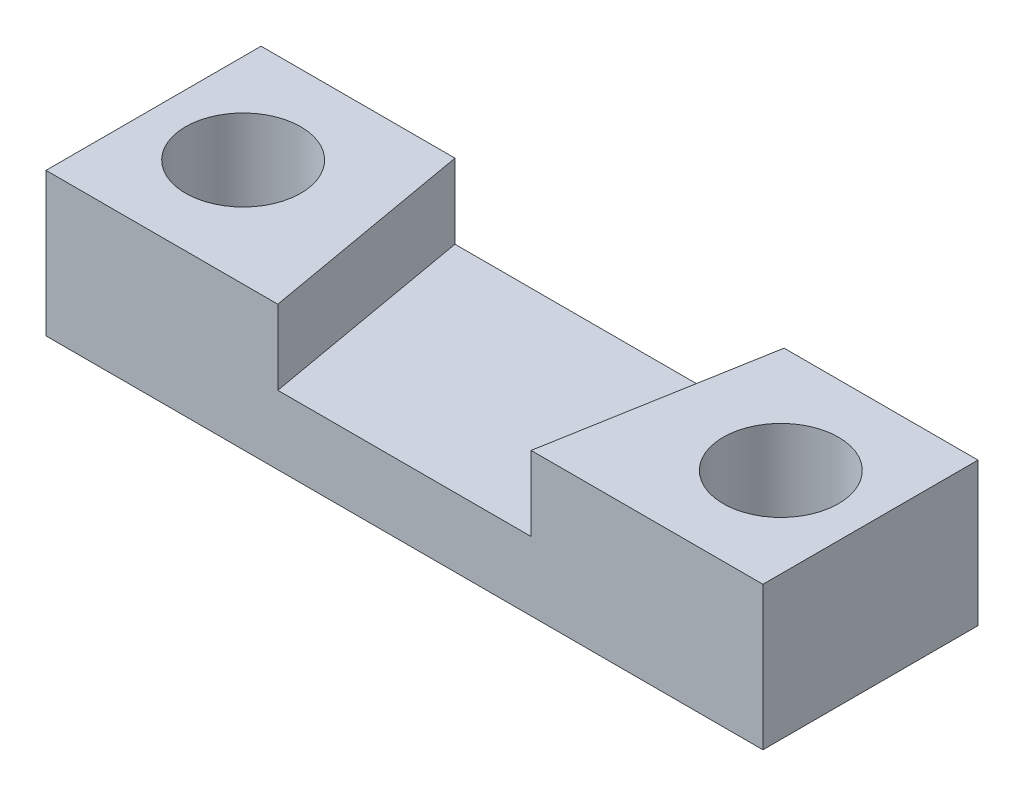
ISO-10303-21;
HEADER;
FILE_DESCRIPTION(('STEP AP214'),'2;1');
FILE_NAME('part.step','',(''),(''),'','','');
FILE_SCHEMA(('AUTOMOTIVE_DESIGN { 1 0 10303 214 1 1 1 1 }'));
ENDSEC;
DATA;
#1=APPLICATION_CONTEXT('core data for automotive mechanical design processes');
#2=APPLICATION_PROTOCOL_DEFINITION('international standard','automotive_design',2000,#1);
#3=PRODUCT_CONTEXT('',#1,'mechanical');
#4=PRODUCT('Part','Part','',(#3));
#5=PRODUCT_RELATED_PRODUCT_CATEGORY('part','',(#4));
#6=PRODUCT_DEFINITION_FORMATION('','',#4);
#7=PRODUCT_DEFINITION_CONTEXT('part definition',#1,'design');
#8=PRODUCT_DEFINITION('design','',#6,#7);
#9=PRODUCT_DEFINITION_SHAPE('','',#8);
#10=(LENGTH_UNIT() NAMED_UNIT(*) SI_UNIT(.MILLI.,.METRE.));
#11=(NAMED_UNIT(*) PLANE_ANGLE_UNIT() SI_UNIT($,.RADIAN.));
#12=(NAMED_UNIT(*) SI_UNIT($,.STERADIAN.) SOLID_ANGLE_UNIT());
#13=UNCERTAINTY_MEASURE_WITH_UNIT(LENGTH_MEASURE(1.E-05),#10,'distance_accuracy_value','');
#14=(GEOMETRIC_REPRESENTATION_CONTEXT(3) GLOBAL_UNCERTAINTY_ASSIGNED_CONTEXT((#13)) GLOBAL_UNIT_ASSIGNED_CONTEXT((#10,
#11,#12)) REPRESENTATION_CONTEXT('',''));
#15=CARTESIAN_POINT('',(0.,0.,0.));
#16=DIRECTION('',(0.,0.,1.));
#17=DIRECTION('',(1.,0.,0.));
#18=AXIS2_PLACEMENT_3D('',#15,#16,#17);
#19=CARTESIAN_POINT('',(0.,6.35,0.));
#20=DIRECTION('',(0.,-1.,0.));
#21=DIRECTION('',(0.,0.,-1.));
#22=AXIS2_PLACEMENT_3D('',#19,#20,#21);
#23=PLANE('',#22);
#24=CARTESIAN_POINT('',(11.90625,6.35,0.));
#25=DIRECTION('',(0.,-1.,0.));
#26=DIRECTION('',(0.,0.,-1.));
#27=AXIS2_PLACEMENT_3D('',#24,#25,#26);
#28=CIRCLE('',#27,2.5527);
#29=CARTESIAN_POINT('',(11.90625,6.35,-2.5527));
#30=VERTEX_POINT('',#29);
#31=EDGE_CURVE('E136',#30,#30,#28,.T.);
#32=ORIENTED_EDGE('',*,*,#31,.T.);
#33=EDGE_LOOP('',(#32));
#34=FACE_BOUND('',#33,.T.);
#35=DIRECTION('',(1.,0.,0.));
#36=VECTOR('',#35,1.);
#37=CARTESIAN_POINT('',(-15.875,6.35,-4.7625));
#38=LINE('',#37,#36);
#39=CARTESIAN_POINT('',(7.28771623109857,6.35,-4.7625));
#40=VERTEX_POINT('',#39);
#41=CARTESIAN_POINT('',(15.875,6.35,-4.7625));
#42=VERTEX_POINT('',#41);
#43=EDGE_CURVE('E142',#40,#42,#38,.T.);
#44=ORIENTED_EDGE('',*,*,#43,.F.);
#45=DIRECTION('',(0.173648177666935,0.,-0.984807753012207));
#46=VECTOR('',#45,1.);
#47=CARTESIAN_POINT('',(7.28771623109857,6.35,-4.7625));
#48=LINE('',#47,#46);
#49=CARTESIAN_POINT('',(5.6082017398504,6.35,4.7625));
#50=VERTEX_POINT('',#49);
#51=EDGE_CURVE('E119',#50,#40,#48,.T.);
#52=ORIENTED_EDGE('',*,*,#51,.F.);
#53=DIRECTION('',(1.,0.,0.));
#54=VECTOR('',#53,1.);
#55=CARTESIAN_POINT('',(-15.875,6.35,4.7625));
#56=LINE('',#55,#54);
#57=CARTESIAN_POINT('',(15.875,6.35,4.7625));
#58=VERTEX_POINT('',#57);
#59=EDGE_CURVE('E148',#50,#58,#56,.T.);
#60=ORIENTED_EDGE('',*,*,#59,.T.);
#61=DIRECTION('',(0.,0.,-1.));
#62=VECTOR('',#61,1.);
#63=CARTESIAN_POINT('',(15.875,6.35,4.7625));
#64=LINE('',#63,#62);
#65=EDGE_CURVE('E145',#58,#42,#64,.T.);
#66=ORIENTED_EDGE('',*,*,#65,.T.);
#67=EDGE_LOOP('',(#44,#52,#60,#66));
#68=FACE_BOUND('',#67,.T.);
#69=ADVANCED_FACE('F32',(#34,#68),#23,.F.);
#70=CARTESIAN_POINT('',(-15.875,6.35,4.7625));
#71=DIRECTION('',(-1.,0.,0.));
#72=DIRECTION('',(0.,0.,1.));
#73=AXIS2_PLACEMENT_3D('',#70,#71,#72);
#74=PLANE('',#73);
#75=DIRECTION('',(0.,0.,-1.));
#76=VECTOR('',#75,1.);
#77=CARTESIAN_POINT('',(-15.875,0.,4.7625));
#78=LINE('',#77,#76);
#79=CARTESIAN_POINT('',(-15.875,0.,4.7625));
#80=VERTEX_POINT('',#79);
#81=CARTESIAN_POINT('',(-15.875,0.,-4.7625));
#82=VERTEX_POINT('',#81);
#83=EDGE_CURVE('E139',#80,#82,#78,.T.);
#84=ORIENTED_EDGE('',*,*,#83,.F.);
#85=DIRECTION('',(0.,-1.,0.));
#86=VECTOR('',#85,1.);
#87=CARTESIAN_POINT('',(-15.875,6.35,4.7625));
#88=LINE('',#87,#86);
#89=CARTESIAN_POINT('',(-15.875,6.35,4.7625));
#90=VERTEX_POINT('',#89);
#91=EDGE_CURVE('E11',#90,#80,#88,.T.);
#92=ORIENTED_EDGE('',*,*,#91,.F.);
#93=DIRECTION('',(0.,0.,-1.));
#94=VECTOR('',#93,1.);
#95=CARTESIAN_POINT('',(-15.875,6.35,4.7625));
#96=LINE('',#95,#94);
#97=CARTESIAN_POINT('',(-15.875,6.35,-4.7625));
#98=VERTEX_POINT('',#97);
#99=EDGE_CURVE('E140',#90,#98,#96,.T.);
#100=ORIENTED_EDGE('',*,*,#99,.T.);
#101=DIRECTION('',(0.,-1.,0.));
#102=VECTOR('',#101,1.);
#103=CARTESIAN_POINT('',(-15.875,6.35,-4.7625));
#104=LINE('',#103,#102);
#105=EDGE_CURVE('E81',#98,#82,#104,.T.);
#106=ORIENTED_EDGE('',*,*,#105,.T.);
#107=EDGE_LOOP('',(#84,#92,#100,#106));
#108=FACE_BOUND('',#107,.T.);
#109=ADVANCED_FACE('F34',(#108),#74,.T.);
#110=CARTESIAN_POINT('',(-15.875,6.35,4.7625));
#111=DIRECTION('',(0.,0.,-1.));
#112=DIRECTION('',(-1.,0.,0.));
#113=AXIS2_PLACEMENT_3D('',#110,#111,#112);
#114=PLANE('',#113);
#115=ORIENTED_EDGE('',*,*,#59,.F.);
#116=DIRECTION('',(0.,1.,0.));
#117=VECTOR('',#116,1.);
#118=CARTESIAN_POINT('',(5.6082017398504,3.048,4.7625));
#119=LINE('',#118,#117);
#120=CARTESIAN_POINT('',(5.6082017398504,3.048,4.7625));
#121=VERTEX_POINT('',#120);
#122=EDGE_CURVE('E124',#121,#50,#119,.T.);
#123=ORIENTED_EDGE('',*,*,#122,.F.);
#124=DIRECTION('',(1.,0.,0.));
#125=VECTOR('',#124,1.);
#126=CARTESIAN_POINT('',(5.6082017398504,3.048,4.7625));
#127=LINE('',#126,#125);
#128=CARTESIAN_POINT('',(-5.6082017398504,3.048,4.7625));
#129=VERTEX_POINT('',#128);
#130=EDGE_CURVE('E110',#129,#121,#127,.T.);
#131=ORIENTED_EDGE('',*,*,#130,.F.);
#132=DIRECTION('',(0.,1.,0.));
#133=VECTOR('',#132,1.);
#134=CARTESIAN_POINT('',(-5.6082017398504,3.048,4.7625));
#135=LINE('',#134,#133);
#136=CARTESIAN_POINT('',(-5.6082017398504,6.35,4.7625));
#137=VERTEX_POINT('',#136);
#138=EDGE_CURVE('E107',#129,#137,#135,.T.);
#139=ORIENTED_EDGE('',*,*,#138,.T.);
#140=EDGE_CURVE('E149',#90,#137,#56,.T.);
#141=ORIENTED_EDGE('',*,*,#140,.F.);
#142=ORIENTED_EDGE('',*,*,#91,.T.);
#143=DIRECTION('',(1.,0.,0.));
#144=VECTOR('',#143,1.);
#145=CARTESIAN_POINT('',(-15.875,0.,4.7625));
#146=LINE('',#145,#144);
#147=CARTESIAN_POINT('',(15.875,0.,4.7625));
#148=VERTEX_POINT('',#147);
#149=EDGE_CURVE('E143',#80,#148,#146,.T.);
#150=ORIENTED_EDGE('',*,*,#149,.T.);
#151=DIRECTION('',(0.,-1.,0.));
#152=VECTOR('',#151,1.);
#153=CARTESIAN_POINT('',(15.875,6.35,4.7625));
#154=LINE('',#153,#152);
#155=EDGE_CURVE('E41',#58,#148,#154,.T.);
#156=ORIENTED_EDGE('',*,*,#155,.F.);
#157=EDGE_LOOP('',(#115,#123,#131,#139,#141,#142,#150,#156));
#158=FACE_BOUND('',#157,.T.);
#159=ADVANCED_FACE('F171',(#158),#114,.F.);
#160=CARTESIAN_POINT('',(15.875,6.35,4.7625));
#161=DIRECTION('',(-1.,0.,0.));
#162=DIRECTION('',(0.,0.,1.));
#163=AXIS2_PLACEMENT_3D('',#160,#161,#162);
#164=PLANE('',#163);
#165=DIRECTION('',(0.,0.,-1.));
#166=VECTOR('',#165,1.);
#167=CARTESIAN_POINT('',(15.875,0.,4.7625));
#168=LINE('',#167,#166);
#169=CARTESIAN_POINT('',(15.875,0.,-4.7625));
#170=VERTEX_POINT('',#169);
#171=EDGE_CURVE('E157',#148,#170,#168,.T.);
#172=ORIENTED_EDGE('',*,*,#171,.T.);
#173=DIRECTION('',(0.,-1.,0.));
#174=VECTOR('',#173,1.);
#175=CARTESIAN_POINT('',(15.875,6.35,-4.7625));
#176=LINE('',#175,#174);
#177=EDGE_CURVE('E163',#42,#170,#176,.T.);
#178=ORIENTED_EDGE('',*,*,#177,.F.);
#179=ORIENTED_EDGE('',*,*,#65,.F.);
#180=ORIENTED_EDGE('',*,*,#155,.T.);
#181=EDGE_LOOP('',(#172,#178,#179,#180));
#182=FACE_BOUND('',#181,.T.);
#183=ADVANCED_FACE('F174',(#182),#164,.F.);
#184=CARTESIAN_POINT('',(-15.875,6.35,-4.7625));
#185=DIRECTION('',(0.,0.,-1.));
#186=DIRECTION('',(-1.,0.,0.));
#187=AXIS2_PLACEMENT_3D('',#184,#185,#186);
#188=PLANE('',#187);
#189=DIRECTION('',(0.,1.,0.));
#190=VECTOR('',#189,1.);
#191=CARTESIAN_POINT('',(7.28771623109857,3.048,-4.7625));
#192=LINE('',#191,#190);
#193=CARTESIAN_POINT('',(7.28771623109857,3.048,-4.7625));
#194=VERTEX_POINT('',#193);
#195=EDGE_CURVE('E132',#194,#40,#192,.T.);
#196=ORIENTED_EDGE('',*,*,#195,.T.);
#197=ORIENTED_EDGE('',*,*,#43,.T.);
#198=ORIENTED_EDGE('',*,*,#177,.T.);
#199=DIRECTION('',(1.,0.,0.));
#200=VECTOR('',#199,1.);
#201=CARTESIAN_POINT('',(-15.875,0.,-4.7625));
#202=LINE('',#201,#200);
#203=EDGE_CURVE('E154',#82,#170,#202,.T.);
#204=ORIENTED_EDGE('',*,*,#203,.F.);
#205=ORIENTED_EDGE('',*,*,#105,.F.);
#206=CARTESIAN_POINT('',(-7.28771623109857,6.35,-4.7625));
#207=VERTEX_POINT('',#206);
#208=EDGE_CURVE('E122',#98,#207,#38,.T.);
#209=ORIENTED_EDGE('',*,*,#208,.T.);
#210=DIRECTION('',(0.,1.,0.));
#211=VECTOR('',#210,1.);
#212=CARTESIAN_POINT('',(-7.28771623109857,3.048,-4.7625));
#213=LINE('',#212,#211);
#214=CARTESIAN_POINT('',(-7.28771623109857,3.048,-4.7625));
#215=VERTEX_POINT('',#214);
#216=EDGE_CURVE('E49',#215,#207,#213,.T.);
#217=ORIENTED_EDGE('',*,*,#216,.F.);
#218=DIRECTION('',(-1.,0.,0.));
#219=VECTOR('',#218,1.);
#220=CARTESIAN_POINT('',(-7.28771623109857,3.048,-4.7625));
#221=LINE('',#220,#219);
#222=EDGE_CURVE('E111',#194,#215,#221,.T.);
#223=ORIENTED_EDGE('',*,*,#222,.F.);
#224=EDGE_LOOP('',(#196,#197,#198,#204,#205,#209,#217,#223));
#225=FACE_BOUND('',#224,.T.);
#226=ADVANCED_FACE('F121',(#225),#188,.T.);
#227=CARTESIAN_POINT('',(-11.90625,6.35,0.));
#228=DIRECTION('',(0.,-1.,0.));
#229=DIRECTION('',(0.,0.,-1.));
#230=AXIS2_PLACEMENT_3D('',#227,#228,#229);
#231=CIRCLE('',#230,2.5527);
#232=CARTESIAN_POINT('',(-11.90625,6.35,-2.5527));
#233=VERTEX_POINT('',#232);
#234=EDGE_CURVE('E36',#233,#233,#231,.T.);
#235=ORIENTED_EDGE('',*,*,#234,.T.);
#236=EDGE_LOOP('',(#235));
#237=FACE_BOUND('',#236,.T.);
#238=ORIENTED_EDGE('',*,*,#140,.T.);
#239=DIRECTION('',(0.173648177666935,0.,0.984807753012207));
#240=VECTOR('',#239,1.);
#241=CARTESIAN_POINT('',(-5.6082017398504,6.35,4.7625));
#242=LINE('',#241,#240);
#243=EDGE_CURVE('E183',#207,#137,#242,.T.);
#244=ORIENTED_EDGE('',*,*,#243,.F.);
#245=ORIENTED_EDGE('',*,*,#208,.F.);
#246=ORIENTED_EDGE('',*,*,#99,.F.);
#247=EDGE_LOOP('',(#238,#244,#245,#246));
#248=FACE_BOUND('',#247,.T.);
#249=ADVANCED_FACE('F201',(#237,#248),#23,.F.);
#250=CARTESIAN_POINT('',(0.,0.,0.));
#251=DIRECTION('',(0.,-1.,0.));
#252=DIRECTION('',(0.,0.,-1.));
#253=AXIS2_PLACEMENT_3D('',#250,#251,#252);
#254=PLANE('',#253);
#255=CARTESIAN_POINT('',(-11.90625,0.,0.));
#256=DIRECTION('',(0.,-1.,0.));
#257=DIRECTION('',(0.,0.,-1.));
#258=AXIS2_PLACEMENT_3D('',#255,#256,#257);
#259=CIRCLE('',#258,2.5527);
#260=CARTESIAN_POINT('',(-11.90625,0.,-2.5527));
#261=VERTEX_POINT('',#260);
#262=EDGE_CURVE('E129',#261,#261,#259,.T.);
#263=ORIENTED_EDGE('',*,*,#262,.F.);
#264=EDGE_LOOP('',(#263));
#265=FACE_BOUND('',#264,.T.);
#266=CARTESIAN_POINT('',(11.90625,0.,0.));
#267=DIRECTION('',(0.,-1.,0.));
#268=DIRECTION('',(0.,0.,-1.));
#269=AXIS2_PLACEMENT_3D('',#266,#267,#268);
#270=CIRCLE('',#269,2.5527);
#271=CARTESIAN_POINT('',(11.90625,0.,-2.5527));
#272=VERTEX_POINT('',#271);
#273=EDGE_CURVE('E133',#272,#272,#270,.T.);
#274=ORIENTED_EDGE('',*,*,#273,.F.);
#275=EDGE_LOOP('',(#274));
#276=FACE_BOUND('',#275,.T.);
#277=ORIENTED_EDGE('',*,*,#83,.T.);
#278=ORIENTED_EDGE('',*,*,#203,.T.);
#279=ORIENTED_EDGE('',*,*,#171,.F.);
#280=ORIENTED_EDGE('',*,*,#149,.F.);
#281=EDGE_LOOP('',(#277,#278,#279,#280));
#282=FACE_BOUND('',#281,.T.);
#283=ADVANCED_FACE('F168',(#265,#276,#282),#254,.T.);
#284=CARTESIAN_POINT('',(11.90625,0.,0.));
#285=DIRECTION('',(0.,-1.,0.));
#286=DIRECTION('',(0.,0.,-1.));
#287=AXIS2_PLACEMENT_3D('',#284,#285,#286);
#288=CYLINDRICAL_SURFACE('',#287,2.5527);
#289=ORIENTED_EDGE('',*,*,#273,.T.);
#290=EDGE_LOOP('',(#289));
#291=FACE_BOUND('',#290,.T.);
#292=ORIENTED_EDGE('',*,*,#31,.F.);
#293=EDGE_LOOP('',(#292));
#294=FACE_BOUND('',#293,.T.);
#295=ADVANCED_FACE('F194',(#291,#294),#288,.F.);
#296=CARTESIAN_POINT('',(-11.90625,0.,0.));
#297=DIRECTION('',(0.,-1.,0.));
#298=DIRECTION('',(0.,0.,-1.));
#299=AXIS2_PLACEMENT_3D('',#296,#297,#298);
#300=CYLINDRICAL_SURFACE('',#299,2.5527);
#301=ORIENTED_EDGE('',*,*,#262,.T.);
#302=EDGE_LOOP('',(#301));
#303=FACE_BOUND('',#302,.T.);
#304=ORIENTED_EDGE('',*,*,#234,.F.);
#305=EDGE_LOOP('',(#304));
#306=FACE_BOUND('',#305,.T.);
#307=ADVANCED_FACE('F187',(#303,#306),#300,.F.);
#308=CARTESIAN_POINT('',(7.28771623109857,3.048,-4.7625));
#309=DIRECTION('',(0.984807753012207,0.,0.173648177666935));
#310=DIRECTION('',(0.173648177666935,0.,-0.984807753012207));
#311=AXIS2_PLACEMENT_3D('',#308,#309,#310);
#312=PLANE('',#311);
#313=ORIENTED_EDGE('',*,*,#51,.T.);
#314=ORIENTED_EDGE('',*,*,#195,.F.);
#315=DIRECTION('',(0.173648177666935,0.,-0.984807753012207));
#316=VECTOR('',#315,1.);
#317=CARTESIAN_POINT('',(7.28771623109857,3.048,-4.7625));
#318=LINE('',#317,#316);
#319=EDGE_CURVE('E117',#121,#194,#318,.T.);
#320=ORIENTED_EDGE('',*,*,#319,.F.);
#321=ORIENTED_EDGE('',*,*,#122,.T.);
#322=EDGE_LOOP('',(#313,#314,#320,#321));
#323=FACE_BOUND('',#322,.T.);
#324=ADVANCED_FACE('F185',(#323),#312,.F.);
#325=CARTESIAN_POINT('',(-5.6082017398504,3.048,4.7625));
#326=DIRECTION('',(-0.984807753012207,0.,0.173648177666935));
#327=DIRECTION('',(0.173648177666935,0.,0.984807753012207));
#328=AXIS2_PLACEMENT_3D('',#325,#326,#327);
#329=PLANE('',#328);
#330=ORIENTED_EDGE('',*,*,#243,.T.);
#331=ORIENTED_EDGE('',*,*,#138,.F.);
#332=DIRECTION('',(0.173648177666935,0.,0.984807753012207));
#333=VECTOR('',#332,1.);
#334=CARTESIAN_POINT('',(-5.6082017398504,3.048,4.7625));
#335=LINE('',#334,#333);
#336=EDGE_CURVE('E103',#215,#129,#335,.T.);
#337=ORIENTED_EDGE('',*,*,#336,.F.);
#338=ORIENTED_EDGE('',*,*,#216,.T.);
#339=EDGE_LOOP('',(#330,#331,#337,#338));
#340=FACE_BOUND('',#339,.T.);
#341=ADVANCED_FACE('F105',(#340),#329,.F.);
#342=CARTESIAN_POINT('',(0.,3.048,0.));
#343=DIRECTION('',(0.,-1.,0.));
#344=DIRECTION('',(0.,0.,-1.));
#345=AXIS2_PLACEMENT_3D('',#342,#343,#344);
#346=PLANE('',#345);
#347=ORIENTED_EDGE('',*,*,#222,.T.);
#348=ORIENTED_EDGE('',*,*,#336,.T.);
#349=ORIENTED_EDGE('',*,*,#130,.T.);
#350=ORIENTED_EDGE('',*,*,#319,.T.);
#351=EDGE_LOOP('',(#347,#348,#349,#350));
#352=FACE_BOUND('',#351,.T.);
#353=ADVANCED_FACE('F115',(#352),#346,.F.);
#354=CLOSED_SHELL('',(#69,#109,#159,#183,#226,#249,#283,#295,#307,#324,#341,#353));
#355=MANIFOLD_SOLID_BREP('B2',#354);
#356=ADVANCED_BREP_SHAPE_REPRESENTATION('',(#18,#355),#14);
#357=SHAPE_DEFINITION_REPRESENTATION(#9,#356);
ENDSEC;
END-ISO-10303-21;
